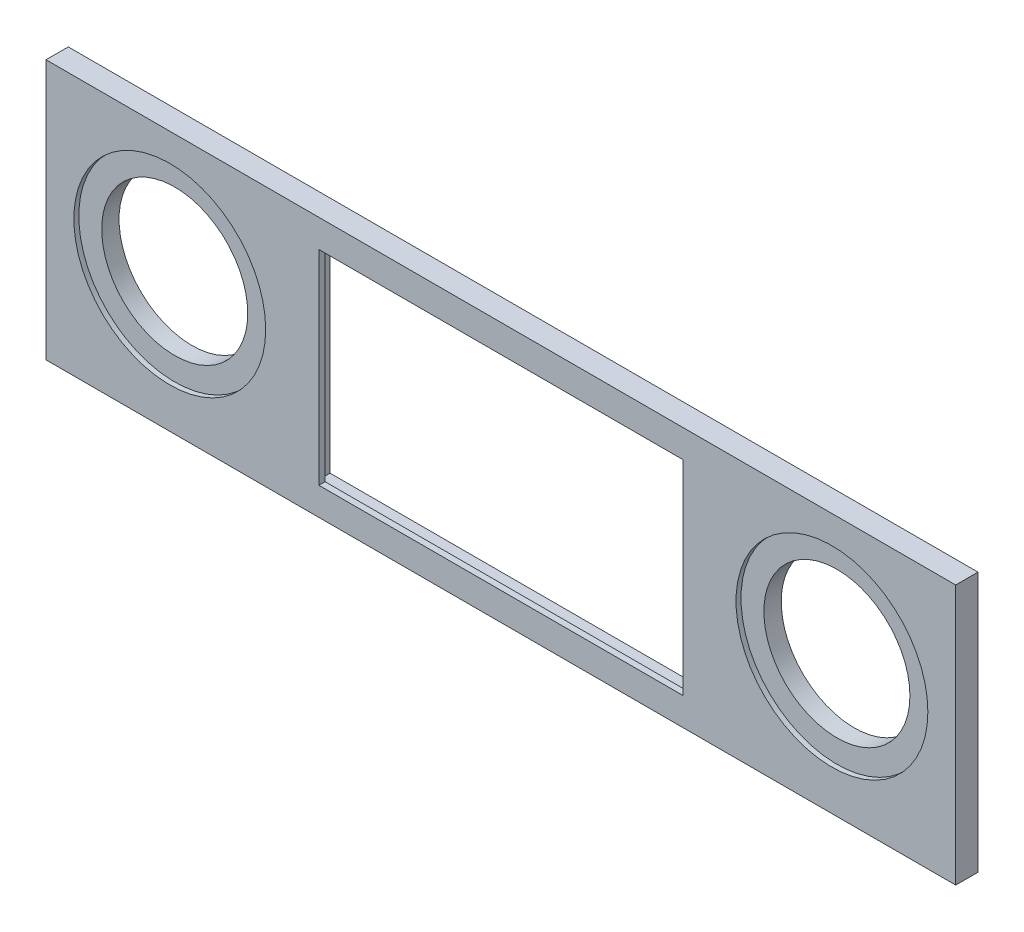
ISO-10303-21;
HEADER;
FILE_DESCRIPTION(('STEP AP214'),'2;1');
FILE_NAME('part.step','',(''),(''),'','','');
FILE_SCHEMA(('AUTOMOTIVE_DESIGN { 1 0 10303 214 1 1 1 1 }'));
ENDSEC;
DATA;
#1=APPLICATION_CONTEXT('core data for automotive mechanical design processes');
#2=APPLICATION_PROTOCOL_DEFINITION('international standard','automotive_design',2000,#1);
#3=PRODUCT_CONTEXT('',#1,'mechanical');
#4=PRODUCT('Part','Part','',(#3));
#5=PRODUCT_RELATED_PRODUCT_CATEGORY('part','',(#4));
#6=PRODUCT_DEFINITION_FORMATION('','',#4);
#7=PRODUCT_DEFINITION_CONTEXT('part definition',#1,'design');
#8=PRODUCT_DEFINITION('design','',#6,#7);
#9=PRODUCT_DEFINITION_SHAPE('','',#8);
#10=(LENGTH_UNIT() NAMED_UNIT(*) SI_UNIT(.MILLI.,.METRE.));
#11=(NAMED_UNIT(*) PLANE_ANGLE_UNIT() SI_UNIT($,.RADIAN.));
#12=(NAMED_UNIT(*) SI_UNIT($,.STERADIAN.) SOLID_ANGLE_UNIT());
#13=UNCERTAINTY_MEASURE_WITH_UNIT(LENGTH_MEASURE(1.E-05),#10,'distance_accuracy_value','');
#14=(GEOMETRIC_REPRESENTATION_CONTEXT(3) GLOBAL_UNCERTAINTY_ASSIGNED_CONTEXT((#13)) GLOBAL_UNIT_ASSIGNED_CONTEXT((#10,
#11,#12)) REPRESENTATION_CONTEXT('',''));
#15=CARTESIAN_POINT('',(0.,0.,0.));
#16=DIRECTION('',(0.,0.,1.));
#17=DIRECTION('',(1.,0.,0.));
#18=AXIS2_PLACEMENT_3D('',#15,#16,#17);
#19=CARTESIAN_POINT('',(-267.5,5.,18.));
#20=DIRECTION('',(0.,0.,-1.));
#21=DIRECTION('',(-1.,0.,0.));
#22=AXIS2_PLACEMENT_3D('',#19,#20,#21);
#23=CYLINDRICAL_SURFACE('',#22,59.);
#24=CARTESIAN_POINT('',(-267.5,5.,0.));
#25=DIRECTION('',(0.,0.,1.));
#26=DIRECTION('',(1.,0.,0.));
#27=AXIS2_PLACEMENT_3D('',#24,#25,#26);
#28=CIRCLE('',#27,59.);
#29=CARTESIAN_POINT('',(-208.5,5.,0.));
#30=VERTEX_POINT('',#29);
#31=EDGE_CURVE('E204',#30,#30,#28,.T.);
#32=ORIENTED_EDGE('',*,*,#31,.F.);
#33=EDGE_LOOP('',(#32));
#34=FACE_BOUND('',#33,.T.);
#35=CARTESIAN_POINT('',(-267.5,5.,14.));
#36=DIRECTION('',(0.,0.,1.));
#37=DIRECTION('',(1.,0.,0.));
#38=AXIS2_PLACEMENT_3D('',#35,#36,#37);
#39=CIRCLE('',#38,59.);
#40=CARTESIAN_POINT('',(-208.5,5.,14.));
#41=VERTEX_POINT('',#40);
#42=EDGE_CURVE('E182',#41,#41,#39,.T.);
#43=ORIENTED_EDGE('',*,*,#42,.T.);
#44=EDGE_LOOP('',(#43));
#45=FACE_BOUND('',#44,.T.);
#46=ADVANCED_FACE('F35',(#34,#45),#23,.F.);
#47=CARTESIAN_POINT('',(267.5,5.,18.));
#48=DIRECTION('',(0.,0.,-1.));
#49=DIRECTION('',(-1.,0.,0.));
#50=AXIS2_PLACEMENT_3D('',#47,#48,#49);
#51=CYLINDRICAL_SURFACE('',#50,59.);
#52=CARTESIAN_POINT('',(267.5,5.,0.));
#53=DIRECTION('',(0.,0.,1.));
#54=DIRECTION('',(1.,0.,0.));
#55=AXIS2_PLACEMENT_3D('',#52,#53,#54);
#56=CIRCLE('',#55,59.);
#57=CARTESIAN_POINT('',(326.5,5.,0.));
#58=VERTEX_POINT('',#57);
#59=EDGE_CURVE('E201',#58,#58,#56,.T.);
#60=ORIENTED_EDGE('',*,*,#59,.F.);
#61=EDGE_LOOP('',(#60));
#62=FACE_BOUND('',#61,.T.);
#63=CARTESIAN_POINT('',(267.5,5.,14.));
#64=DIRECTION('',(0.,0.,1.));
#65=DIRECTION('',(1.,0.,0.));
#66=AXIS2_PLACEMENT_3D('',#63,#64,#65);
#67=CIRCLE('',#66,59.);
#68=CARTESIAN_POINT('',(326.5,5.,14.));
#69=VERTEX_POINT('',#68);
#70=EDGE_CURVE('E170',#69,#69,#67,.T.);
#71=ORIENTED_EDGE('',*,*,#70,.T.);
#72=EDGE_LOOP('',(#71));
#73=FACE_BOUND('',#72,.T.);
#74=ADVANCED_FACE('F258',(#62,#73),#51,.F.);
#75=CARTESIAN_POINT('',(0.,0.,18.));
#76=DIRECTION('',(0.,0.,-1.));
#77=DIRECTION('',(-1.,0.,0.));
#78=AXIS2_PLACEMENT_3D('',#75,#76,#77);
#79=PLANE('',#78);
#80=CARTESIAN_POINT('',(-267.5,5.,18.));
#81=DIRECTION('',(0.,0.,1.));
#82=DIRECTION('',(1.,0.,0.));
#83=AXIS2_PLACEMENT_3D('',#80,#81,#82);
#84=CIRCLE('',#83,77.5);
#85=CARTESIAN_POINT('',(-190.,5.,18.));
#86=VERTEX_POINT('',#85);
#87=EDGE_CURVE('E171',#86,#86,#84,.T.);
#88=ORIENTED_EDGE('',*,*,#87,.F.);
#89=EDGE_LOOP('',(#88));
#90=FACE_BOUND('',#89,.T.);
#91=CARTESIAN_POINT('',(267.5,5.,18.));
#92=DIRECTION('',(0.,0.,1.));
#93=DIRECTION('',(1.,0.,0.));
#94=AXIS2_PLACEMENT_3D('',#91,#92,#93);
#95=CIRCLE('',#94,77.5);
#96=CARTESIAN_POINT('',(345.,5.,18.));
#97=VERTEX_POINT('',#96);
#98=EDGE_CURVE('E166',#97,#97,#95,.T.);
#99=ORIENTED_EDGE('',*,*,#98,.F.);
#100=EDGE_LOOP('',(#99));
#101=FACE_BOUND('',#100,.T.);
#102=DIRECTION('',(0.,1.,0.));
#103=VECTOR('',#102,1.);
#104=CARTESIAN_POINT('',(367.5,-105.,18.));
#105=LINE('',#104,#103);
#106=CARTESIAN_POINT('',(367.5,-105.,18.));
#107=VERTEX_POINT('',#106);
#108=CARTESIAN_POINT('',(367.5,105.,18.));
#109=VERTEX_POINT('',#108);
#110=EDGE_CURVE('E208',#107,#109,#105,.T.);
#111=ORIENTED_EDGE('',*,*,#110,.T.);
#112=DIRECTION('',(-1.,0.,0.));
#113=VECTOR('',#112,1.);
#114=CARTESIAN_POINT('',(-367.5,105.,18.));
#115=LINE('',#114,#113);
#116=CARTESIAN_POINT('',(-367.5,105.,18.));
#117=VERTEX_POINT('',#116);
#118=EDGE_CURVE('E211',#109,#117,#115,.T.);
#119=ORIENTED_EDGE('',*,*,#118,.T.);
#120=DIRECTION('',(0.,-1.,0.));
#121=VECTOR('',#120,1.);
#122=CARTESIAN_POINT('',(-367.5,-105.,18.));
#123=LINE('',#122,#121);
#124=CARTESIAN_POINT('',(-367.5,-105.,18.));
#125=VERTEX_POINT('',#124);
#126=EDGE_CURVE('E214',#117,#125,#123,.T.);
#127=ORIENTED_EDGE('',*,*,#126,.T.);
#128=DIRECTION('',(1.,0.,0.));
#129=VECTOR('',#128,1.);
#130=CARTESIAN_POINT('',(-367.5,-105.,18.));
#131=LINE('',#130,#129);
#132=EDGE_CURVE('E216',#125,#107,#131,.T.);
#133=ORIENTED_EDGE('',*,*,#132,.T.);
#134=EDGE_LOOP('',(#111,#119,#127,#133));
#135=FACE_BOUND('',#134,.T.);
#136=DIRECTION('',(0.,1.,0.));
#137=VECTOR('',#136,1.);
#138=CARTESIAN_POINT('',(147.,-82.4999999999999,18.));
#139=LINE('',#138,#137);
#140=CARTESIAN_POINT('',(147.,-82.4999999999999,18.));
#141=VERTEX_POINT('',#140);
#142=CARTESIAN_POINT('',(147.,82.5000000000001,18.));
#143=VERTEX_POINT('',#142);
#144=EDGE_CURVE('E179',#141,#143,#139,.T.);
#145=ORIENTED_EDGE('',*,*,#144,.F.);
#146=DIRECTION('',(1.,0.,0.));
#147=VECTOR('',#146,1.);
#148=CARTESIAN_POINT('',(-147.,-82.4999999999999,18.));
#149=LINE('',#148,#147);
#150=CARTESIAN_POINT('',(-147.,-82.4999999999999,18.));
#151=VERTEX_POINT('',#150);
#152=EDGE_CURVE('E187',#151,#141,#149,.T.);
#153=ORIENTED_EDGE('',*,*,#152,.F.);
#154=DIRECTION('',(0.,-1.,0.));
#155=VECTOR('',#154,1.);
#156=CARTESIAN_POINT('',(-147.,-82.4999999999999,18.));
#157=LINE('',#156,#155);
#158=CARTESIAN_POINT('',(-147.,82.5000000000001,18.));
#159=VERTEX_POINT('',#158);
#160=EDGE_CURVE('E184',#159,#151,#157,.T.);
#161=ORIENTED_EDGE('',*,*,#160,.F.);
#162=DIRECTION('',(-1.,0.,0.));
#163=VECTOR('',#162,1.);
#164=CARTESIAN_POINT('',(-147.,82.5000000000001,18.));
#165=LINE('',#164,#163);
#166=EDGE_CURVE('E181',#143,#159,#165,.T.);
#167=ORIENTED_EDGE('',*,*,#166,.F.);
#168=EDGE_LOOP('',(#145,#153,#161,#167));
#169=FACE_BOUND('',#168,.T.);
#170=ADVANCED_FACE('F254',(#90,#101,#135,#169),#79,.F.);
#171=CARTESIAN_POINT('',(0.,0.,0.));
#172=DIRECTION('',(0.,0.,-1.));
#173=DIRECTION('',(-1.,0.,0.));
#174=AXIS2_PLACEMENT_3D('',#171,#172,#173);
#175=PLANE('',#174);
#176=DIRECTION('',(0.,1.,0.));
#177=VECTOR('',#176,1.);
#178=CARTESIAN_POINT('',(-156.,-87.5,0.));
#179=LINE('',#178,#177);
#180=CARTESIAN_POINT('',(-156.,-87.5,0.));
#181=VERTEX_POINT('',#180);
#182=CARTESIAN_POINT('',(-156.,87.5,0.));
#183=VERTEX_POINT('',#182);
#184=EDGE_CURVE('E50',#181,#183,#179,.T.);
#185=ORIENTED_EDGE('',*,*,#184,.F.);
#186=DIRECTION('',(-1.,0.,0.));
#187=VECTOR('',#186,1.);
#188=CARTESIAN_POINT('',(156.,-87.5,0.));
#189=LINE('',#188,#187);
#190=CARTESIAN_POINT('',(156.,-87.5,0.));
#191=VERTEX_POINT('',#190);
#192=EDGE_CURVE('E143',#191,#181,#189,.T.);
#193=ORIENTED_EDGE('',*,*,#192,.F.);
#194=DIRECTION('',(0.,-1.,0.));
#195=VECTOR('',#194,1.);
#196=CARTESIAN_POINT('',(156.,-87.5,0.));
#197=LINE('',#196,#195);
#198=CARTESIAN_POINT('',(156.,87.5,0.));
#199=VERTEX_POINT('',#198);
#200=EDGE_CURVE('E146',#199,#191,#197,.T.);
#201=ORIENTED_EDGE('',*,*,#200,.F.);
#202=DIRECTION('',(1.,0.,0.));
#203=VECTOR('',#202,1.);
#204=CARTESIAN_POINT('',(156.,87.5,0.));
#205=LINE('',#204,#203);
#206=EDGE_CURVE('E152',#183,#199,#205,.T.);
#207=ORIENTED_EDGE('',*,*,#206,.F.);
#208=EDGE_LOOP('',(#185,#193,#201,#207));
#209=FACE_BOUND('',#208,.T.);
#210=ORIENTED_EDGE('',*,*,#31,.T.);
#211=EDGE_LOOP('',(#210));
#212=FACE_BOUND('',#211,.T.);
#213=DIRECTION('',(0.,1.,0.));
#214=VECTOR('',#213,1.);
#215=CARTESIAN_POINT('',(367.5,-105.,0.));
#216=LINE('',#215,#214);
#217=CARTESIAN_POINT('',(367.5,-105.,0.));
#218=VERTEX_POINT('',#217);
#219=CARTESIAN_POINT('',(367.5,105.,0.));
#220=VERTEX_POINT('',#219);
#221=EDGE_CURVE('E207',#218,#220,#216,.T.);
#222=ORIENTED_EDGE('',*,*,#221,.F.);
#223=DIRECTION('',(1.,0.,0.));
#224=VECTOR('',#223,1.);
#225=CARTESIAN_POINT('',(-367.5,-105.,0.));
#226=LINE('',#225,#224);
#227=CARTESIAN_POINT('',(-367.5,-105.,0.));
#228=VERTEX_POINT('',#227);
#229=EDGE_CURVE('E212',#228,#218,#226,.T.);
#230=ORIENTED_EDGE('',*,*,#229,.F.);
#231=DIRECTION('',(0.,-1.,0.));
#232=VECTOR('',#231,1.);
#233=CARTESIAN_POINT('',(-367.5,-105.,0.));
#234=LINE('',#233,#232);
#235=CARTESIAN_POINT('',(-367.5,105.,0.));
#236=VERTEX_POINT('',#235);
#237=EDGE_CURVE('E223',#236,#228,#234,.T.);
#238=ORIENTED_EDGE('',*,*,#237,.F.);
#239=DIRECTION('',(-1.,0.,0.));
#240=VECTOR('',#239,1.);
#241=CARTESIAN_POINT('',(-367.5,105.,0.));
#242=LINE('',#241,#240);
#243=EDGE_CURVE('E221',#220,#236,#242,.T.);
#244=ORIENTED_EDGE('',*,*,#243,.F.);
#245=EDGE_LOOP('',(#222,#230,#238,#244));
#246=FACE_BOUND('',#245,.T.);
#247=ORIENTED_EDGE('',*,*,#59,.T.);
#248=EDGE_LOOP('',(#247));
#249=FACE_BOUND('',#248,.T.);
#250=ADVANCED_FACE('F257',(#209,#212,#246,#249),#175,.T.);
#251=CARTESIAN_POINT('',(367.5,-105.,18.));
#252=DIRECTION('',(-1.,0.,0.));
#253=DIRECTION('',(0.,0.,1.));
#254=AXIS2_PLACEMENT_3D('',#251,#252,#253);
#255=PLANE('',#254);
#256=ORIENTED_EDGE('',*,*,#221,.T.);
#257=DIRECTION('',(0.,0.,-1.));
#258=VECTOR('',#257,1.);
#259=CARTESIAN_POINT('',(367.5,105.,18.));
#260=LINE('',#259,#258);
#261=EDGE_CURVE('E43',#109,#220,#260,.T.);
#262=ORIENTED_EDGE('',*,*,#261,.F.);
#263=ORIENTED_EDGE('',*,*,#110,.F.);
#264=DIRECTION('',(0.,0.,-1.));
#265=VECTOR('',#264,1.);
#266=CARTESIAN_POINT('',(367.5,-105.,18.));
#267=LINE('',#266,#265);
#268=EDGE_CURVE('E218',#107,#218,#267,.T.);
#269=ORIENTED_EDGE('',*,*,#268,.T.);
#270=EDGE_LOOP('',(#256,#262,#263,#269));
#271=FACE_BOUND('',#270,.T.);
#272=ADVANCED_FACE('F37',(#271),#255,.F.);
#273=CARTESIAN_POINT('',(-367.5,105.,18.));
#274=DIRECTION('',(0.,-1.,0.));
#275=DIRECTION('',(0.,0.,-1.));
#276=AXIS2_PLACEMENT_3D('',#273,#274,#275);
#277=PLANE('',#276);
#278=ORIENTED_EDGE('',*,*,#243,.T.);
#279=DIRECTION('',(0.,0.,-1.));
#280=VECTOR('',#279,1.);
#281=CARTESIAN_POINT('',(-367.5,105.,18.));
#282=LINE('',#281,#280);
#283=EDGE_CURVE('E231',#117,#236,#282,.T.);
#284=ORIENTED_EDGE('',*,*,#283,.F.);
#285=ORIENTED_EDGE('',*,*,#118,.F.);
#286=ORIENTED_EDGE('',*,*,#261,.T.);
#287=EDGE_LOOP('',(#278,#284,#285,#286));
#288=FACE_BOUND('',#287,.T.);
#289=ADVANCED_FACE('F312',(#288),#277,.F.);
#290=CARTESIAN_POINT('',(-367.5,-105.,18.));
#291=DIRECTION('',(1.,0.,0.));
#292=DIRECTION('',(0.,0.,-1.));
#293=AXIS2_PLACEMENT_3D('',#290,#291,#292);
#294=PLANE('',#293);
#295=ORIENTED_EDGE('',*,*,#237,.T.);
#296=DIRECTION('',(0.,0.,-1.));
#297=VECTOR('',#296,1.);
#298=CARTESIAN_POINT('',(-367.5,-105.,18.));
#299=LINE('',#298,#297);
#300=EDGE_CURVE('E228',#125,#228,#299,.T.);
#301=ORIENTED_EDGE('',*,*,#300,.F.);
#302=ORIENTED_EDGE('',*,*,#126,.F.);
#303=ORIENTED_EDGE('',*,*,#283,.T.);
#304=EDGE_LOOP('',(#295,#301,#302,#303));
#305=FACE_BOUND('',#304,.T.);
#306=ADVANCED_FACE('F309',(#305),#294,.F.);
#307=CARTESIAN_POINT('',(-367.5,-105.,18.));
#308=DIRECTION('',(0.,1.,0.));
#309=DIRECTION('',(0.,0.,1.));
#310=AXIS2_PLACEMENT_3D('',#307,#308,#309);
#311=PLANE('',#310);
#312=ORIENTED_EDGE('',*,*,#229,.T.);
#313=ORIENTED_EDGE('',*,*,#268,.F.);
#314=ORIENTED_EDGE('',*,*,#132,.F.);
#315=ORIENTED_EDGE('',*,*,#300,.T.);
#316=EDGE_LOOP('',(#312,#313,#314,#315));
#317=FACE_BOUND('',#316,.T.);
#318=ADVANCED_FACE('F306',(#317),#311,.F.);
#319=CARTESIAN_POINT('',(147.,-82.4999999999999,18.));
#320=DIRECTION('',(-1.,0.,0.));
#321=DIRECTION('',(0.,0.,1.));
#322=AXIS2_PLACEMENT_3D('',#319,#320,#321);
#323=PLANE('',#322);
#324=DIRECTION('',(0.,1.,0.));
#325=VECTOR('',#324,1.);
#326=CARTESIAN_POINT('',(147.,-82.4999999999999,13.));
#327=LINE('',#326,#325);
#328=CARTESIAN_POINT('',(147.,-82.4999999999999,13.));
#329=VERTEX_POINT('',#328);
#330=CARTESIAN_POINT('',(147.,82.5000000000001,13.));
#331=VERTEX_POINT('',#330);
#332=EDGE_CURVE('E164',#329,#331,#327,.T.);
#333=ORIENTED_EDGE('',*,*,#332,.F.);
#334=DIRECTION('',(0.,0.,-1.));
#335=VECTOR('',#334,1.);
#336=CARTESIAN_POINT('',(147.,-82.4999999999999,18.));
#337=LINE('',#336,#335);
#338=EDGE_CURVE('E189',#141,#329,#337,.T.);
#339=ORIENTED_EDGE('',*,*,#338,.F.);
#340=ORIENTED_EDGE('',*,*,#144,.T.);
#341=DIRECTION('',(0.,0.,-1.));
#342=VECTOR('',#341,1.);
#343=CARTESIAN_POINT('',(147.,82.5000000000001,18.));
#344=LINE('',#343,#342);
#345=EDGE_CURVE('E198',#143,#331,#344,.T.);
#346=ORIENTED_EDGE('',*,*,#345,.T.);
#347=EDGE_LOOP('',(#333,#339,#340,#346));
#348=FACE_BOUND('',#347,.T.);
#349=ADVANCED_FACE('F273',(#348),#323,.T.);
#350=CARTESIAN_POINT('',(-147.,82.5000000000001,18.));
#351=DIRECTION('',(0.,-1.,0.));
#352=DIRECTION('',(0.,0.,-1.));
#353=AXIS2_PLACEMENT_3D('',#350,#351,#352);
#354=PLANE('',#353);
#355=DIRECTION('',(-1.,0.,0.));
#356=VECTOR('',#355,1.);
#357=CARTESIAN_POINT('',(-147.,82.5000000000001,13.));
#358=LINE('',#357,#356);
#359=CARTESIAN_POINT('',(-147.,82.5000000000001,13.));
#360=VERTEX_POINT('',#359);
#361=EDGE_CURVE('E162',#331,#360,#358,.T.);
#362=ORIENTED_EDGE('',*,*,#361,.F.);
#363=ORIENTED_EDGE('',*,*,#345,.F.);
#364=ORIENTED_EDGE('',*,*,#166,.T.);
#365=DIRECTION('',(0.,0.,-1.));
#366=VECTOR('',#365,1.);
#367=CARTESIAN_POINT('',(-147.,82.5000000000001,18.));
#368=LINE('',#367,#366);
#369=EDGE_CURVE('E195',#159,#360,#368,.T.);
#370=ORIENTED_EDGE('',*,*,#369,.T.);
#371=EDGE_LOOP('',(#362,#363,#364,#370));
#372=FACE_BOUND('',#371,.T.);
#373=ADVANCED_FACE('F276',(#372),#354,.T.);
#374=CARTESIAN_POINT('',(-147.,-82.4999999999999,18.));
#375=DIRECTION('',(1.,0.,0.));
#376=DIRECTION('',(0.,0.,-1.));
#377=AXIS2_PLACEMENT_3D('',#374,#375,#376);
#378=PLANE('',#377);
#379=DIRECTION('',(0.,-1.,0.));
#380=VECTOR('',#379,1.);
#381=CARTESIAN_POINT('',(-147.,-82.4999999999999,13.));
#382=LINE('',#381,#380);
#383=CARTESIAN_POINT('',(-147.,-82.4999999999999,13.));
#384=VERTEX_POINT('',#383);
#385=EDGE_CURVE('E57',#360,#384,#382,.T.);
#386=ORIENTED_EDGE('',*,*,#385,.F.);
#387=ORIENTED_EDGE('',*,*,#369,.F.);
#388=ORIENTED_EDGE('',*,*,#160,.T.);
#389=DIRECTION('',(0.,0.,-1.));
#390=VECTOR('',#389,1.);
#391=CARTESIAN_POINT('',(-147.,-82.4999999999999,18.));
#392=LINE('',#391,#390);
#393=EDGE_CURVE('E192',#151,#384,#392,.T.);
#394=ORIENTED_EDGE('',*,*,#393,.T.);
#395=EDGE_LOOP('',(#386,#387,#388,#394));
#396=FACE_BOUND('',#395,.T.);
#397=ADVANCED_FACE('F279',(#396),#378,.T.);
#398=CARTESIAN_POINT('',(-147.,-82.4999999999999,18.));
#399=DIRECTION('',(0.,1.,0.));
#400=DIRECTION('',(0.,0.,1.));
#401=AXIS2_PLACEMENT_3D('',#398,#399,#400);
#402=PLANE('',#401);
#403=DIRECTION('',(1.,0.,0.));
#404=VECTOR('',#403,1.);
#405=CARTESIAN_POINT('',(-147.,-82.4999999999999,13.));
#406=LINE('',#405,#404);
#407=EDGE_CURVE('E11',#384,#329,#406,.T.);
#408=ORIENTED_EDGE('',*,*,#407,.F.);
#409=ORIENTED_EDGE('',*,*,#393,.F.);
#410=ORIENTED_EDGE('',*,*,#152,.T.);
#411=ORIENTED_EDGE('',*,*,#338,.T.);
#412=EDGE_LOOP('',(#408,#409,#410,#411));
#413=FACE_BOUND('',#412,.T.);
#414=ADVANCED_FACE('F281',(#413),#402,.T.);
#415=CARTESIAN_POINT('',(267.5,5.,14.));
#416=DIRECTION('',(0.,0.,1.));
#417=DIRECTION('',(1.,0.,0.));
#418=AXIS2_PLACEMENT_3D('',#415,#416,#417);
#419=CYLINDRICAL_SURFACE('',#418,77.5);
#420=CARTESIAN_POINT('',(267.5,5.,14.));
#421=DIRECTION('',(0.,0.,1.));
#422=DIRECTION('',(1.,0.,0.));
#423=AXIS2_PLACEMENT_3D('',#420,#421,#422);
#424=CIRCLE('',#423,77.5);
#425=CARTESIAN_POINT('',(345.,5.,14.));
#426=VERTEX_POINT('',#425);
#427=EDGE_CURVE('E174',#426,#426,#424,.T.);
#428=ORIENTED_EDGE('',*,*,#427,.F.);
#429=EDGE_LOOP('',(#428));
#430=FACE_BOUND('',#429,.T.);
#431=ORIENTED_EDGE('',*,*,#98,.T.);
#432=EDGE_LOOP('',(#431));
#433=FACE_BOUND('',#432,.T.);
#434=ADVANCED_FACE('F283',(#430,#433),#419,.F.);
#435=CARTESIAN_POINT('',(267.5,5.,14.));
#436=DIRECTION('',(0.,0.,1.));
#437=DIRECTION('',(1.,0.,0.));
#438=AXIS2_PLACEMENT_3D('',#435,#436,#437);
#439=PLANE('',#438);
#440=ORIENTED_EDGE('',*,*,#70,.F.);
#441=EDGE_LOOP('',(#440));
#442=FACE_BOUND('',#441,.T.);
#443=ORIENTED_EDGE('',*,*,#427,.T.);
#444=EDGE_LOOP('',(#443));
#445=FACE_BOUND('',#444,.T.);
#446=ADVANCED_FACE('F250',(#442,#445),#439,.T.);
#447=CARTESIAN_POINT('',(-267.5,5.,14.));
#448=DIRECTION('',(0.,0.,1.));
#449=DIRECTION('',(1.,0.,0.));
#450=AXIS2_PLACEMENT_3D('',#447,#448,#449);
#451=CYLINDRICAL_SURFACE('',#450,77.5);
#452=CARTESIAN_POINT('',(-267.5,5.,14.));
#453=DIRECTION('',(0.,0.,1.));
#454=DIRECTION('',(1.,0.,0.));
#455=AXIS2_PLACEMENT_3D('',#452,#453,#454);
#456=CIRCLE('',#455,77.5);
#457=CARTESIAN_POINT('',(-190.,5.,14.));
#458=VERTEX_POINT('',#457);
#459=EDGE_CURVE('E167',#458,#458,#456,.T.);
#460=ORIENTED_EDGE('',*,*,#459,.F.);
#461=EDGE_LOOP('',(#460));
#462=FACE_BOUND('',#461,.T.);
#463=ORIENTED_EDGE('',*,*,#87,.T.);
#464=EDGE_LOOP('',(#463));
#465=FACE_BOUND('',#464,.T.);
#466=ADVANCED_FACE('F244',(#462,#465),#451,.F.);
#467=CARTESIAN_POINT('',(-267.5,5.,14.));
#468=DIRECTION('',(0.,0.,1.));
#469=DIRECTION('',(1.,0.,0.));
#470=AXIS2_PLACEMENT_3D('',#467,#468,#469);
#471=PLANE('',#470);
#472=ORIENTED_EDGE('',*,*,#42,.F.);
#473=EDGE_LOOP('',(#472));
#474=FACE_BOUND('',#473,.T.);
#475=ORIENTED_EDGE('',*,*,#459,.T.);
#476=EDGE_LOOP('',(#475));
#477=FACE_BOUND('',#476,.T.);
#478=ADVANCED_FACE('F241',(#474,#477),#471,.T.);
#479=CARTESIAN_POINT('',(-156.,-87.5,13.));
#480=DIRECTION('',(-1.,0.,0.));
#481=DIRECTION('',(0.,0.,1.));
#482=AXIS2_PLACEMENT_3D('',#479,#480,#481);
#483=PLANE('',#482);
#484=ORIENTED_EDGE('',*,*,#184,.T.);
#485=DIRECTION('',(0.,0.,-1.));
#486=VECTOR('',#485,1.);
#487=CARTESIAN_POINT('',(-156.,87.5,13.));
#488=LINE('',#487,#486);
#489=CARTESIAN_POINT('',(-156.,87.5,13.));
#490=VERTEX_POINT('',#489);
#491=EDGE_CURVE('E121',#490,#183,#488,.T.);
#492=ORIENTED_EDGE('',*,*,#491,.F.);
#493=DIRECTION('',(0.,1.,0.));
#494=VECTOR('',#493,1.);
#495=CARTESIAN_POINT('',(-156.,-87.5,13.));
#496=LINE('',#495,#494);
#497=CARTESIAN_POINT('',(-156.,-87.5,13.));
#498=VERTEX_POINT('',#497);
#499=EDGE_CURVE('E125',#498,#490,#496,.T.);
#500=ORIENTED_EDGE('',*,*,#499,.F.);
#501=DIRECTION('',(0.,0.,-1.));
#502=VECTOR('',#501,1.);
#503=CARTESIAN_POINT('',(-156.,-87.5,13.));
#504=LINE('',#503,#502);
#505=EDGE_CURVE('E156',#498,#181,#504,.T.);
#506=ORIENTED_EDGE('',*,*,#505,.T.);
#507=EDGE_LOOP('',(#484,#492,#500,#506));
#508=FACE_BOUND('',#507,.T.);
#509=ADVANCED_FACE('F123',(#508),#483,.F.);
#510=CARTESIAN_POINT('',(156.,-87.5,13.));
#511=DIRECTION('',(0.,-1.,0.));
#512=DIRECTION('',(0.,0.,-1.));
#513=AXIS2_PLACEMENT_3D('',#510,#511,#512);
#514=PLANE('',#513);
#515=ORIENTED_EDGE('',*,*,#192,.T.);
#516=ORIENTED_EDGE('',*,*,#505,.F.);
#517=DIRECTION('',(-1.,0.,0.));
#518=VECTOR('',#517,1.);
#519=CARTESIAN_POINT('',(156.,-87.5,13.));
#520=LINE('',#519,#518);
#521=CARTESIAN_POINT('',(156.,-87.5,13.));
#522=VERTEX_POINT('',#521);
#523=EDGE_CURVE('E131',#522,#498,#520,.T.);
#524=ORIENTED_EDGE('',*,*,#523,.F.);
#525=DIRECTION('',(0.,0.,-1.));
#526=VECTOR('',#525,1.);
#527=CARTESIAN_POINT('',(156.,-87.5,13.));
#528=LINE('',#527,#526);
#529=EDGE_CURVE('E158',#522,#191,#528,.T.);
#530=ORIENTED_EDGE('',*,*,#529,.T.);
#531=EDGE_LOOP('',(#515,#516,#524,#530));
#532=FACE_BOUND('',#531,.T.);
#533=ADVANCED_FACE('F344',(#532),#514,.F.);
#534=CARTESIAN_POINT('',(156.,-87.5,13.));
#535=DIRECTION('',(1.,0.,0.));
#536=DIRECTION('',(0.,0.,-1.));
#537=AXIS2_PLACEMENT_3D('',#534,#535,#536);
#538=PLANE('',#537);
#539=ORIENTED_EDGE('',*,*,#200,.T.);
#540=ORIENTED_EDGE('',*,*,#529,.F.);
#541=DIRECTION('',(0.,-1.,0.));
#542=VECTOR('',#541,1.);
#543=CARTESIAN_POINT('',(156.,-87.5,13.));
#544=LINE('',#543,#542);
#545=CARTESIAN_POINT('',(156.,87.5,13.));
#546=VERTEX_POINT('',#545);
#547=EDGE_CURVE('E139',#546,#522,#544,.T.);
#548=ORIENTED_EDGE('',*,*,#547,.F.);
#549=DIRECTION('',(0.,0.,-1.));
#550=VECTOR('',#549,1.);
#551=CARTESIAN_POINT('',(156.,87.5,13.));
#552=LINE('',#551,#550);
#553=EDGE_CURVE('E130',#546,#199,#552,.T.);
#554=ORIENTED_EDGE('',*,*,#553,.T.);
#555=EDGE_LOOP('',(#539,#540,#548,#554));
#556=FACE_BOUND('',#555,.T.);
#557=ADVANCED_FACE('F347',(#556),#538,.F.);
#558=CARTESIAN_POINT('',(156.,87.5,13.));
#559=DIRECTION('',(0.,1.,0.));
#560=DIRECTION('',(0.,0.,1.));
#561=AXIS2_PLACEMENT_3D('',#558,#559,#560);
#562=PLANE('',#561);
#563=ORIENTED_EDGE('',*,*,#206,.T.);
#564=ORIENTED_EDGE('',*,*,#553,.F.);
#565=DIRECTION('',(1.,0.,0.));
#566=VECTOR('',#565,1.);
#567=CARTESIAN_POINT('',(156.,87.5,13.));
#568=LINE('',#567,#566);
#569=EDGE_CURVE('E134',#490,#546,#568,.T.);
#570=ORIENTED_EDGE('',*,*,#569,.F.);
#571=ORIENTED_EDGE('',*,*,#491,.T.);
#572=EDGE_LOOP('',(#563,#564,#570,#571));
#573=FACE_BOUND('',#572,.T.);
#574=ADVANCED_FACE('F135',(#573),#562,.F.);
#575=CARTESIAN_POINT('',(0.,0.,13.));
#576=DIRECTION('',(0.,0.,1.));
#577=DIRECTION('',(1.,0.,0.));
#578=AXIS2_PLACEMENT_3D('',#575,#576,#577);
#579=PLANE('',#578);
#580=ORIENTED_EDGE('',*,*,#332,.T.);
#581=ORIENTED_EDGE('',*,*,#361,.T.);
#582=ORIENTED_EDGE('',*,*,#385,.T.);
#583=ORIENTED_EDGE('',*,*,#407,.T.);
#584=EDGE_LOOP('',(#580,#581,#582,#583));
#585=FACE_BOUND('',#584,.T.);
#586=ORIENTED_EDGE('',*,*,#499,.T.);
#587=ORIENTED_EDGE('',*,*,#569,.T.);
#588=ORIENTED_EDGE('',*,*,#547,.T.);
#589=ORIENTED_EDGE('',*,*,#523,.T.);
#590=EDGE_LOOP('',(#586,#587,#588,#589));
#591=FACE_BOUND('',#590,.T.);
#592=ADVANCED_FACE('F141',(#585,#591),#579,.F.);
#593=CLOSED_SHELL('',(#46,#74,#170,#250,#272,#289,#306,#318,#349,#373,#397,#414,#434,#446,#466,
#478,#509,#533,#557,#574,#592));
#594=MANIFOLD_SOLID_BREP('B2',#593);
#595=ADVANCED_BREP_SHAPE_REPRESENTATION('',(#18,#594),#14);
#596=SHAPE_DEFINITION_REPRESENTATION(#9,#595);
ENDSEC;
END-ISO-10303-21;
